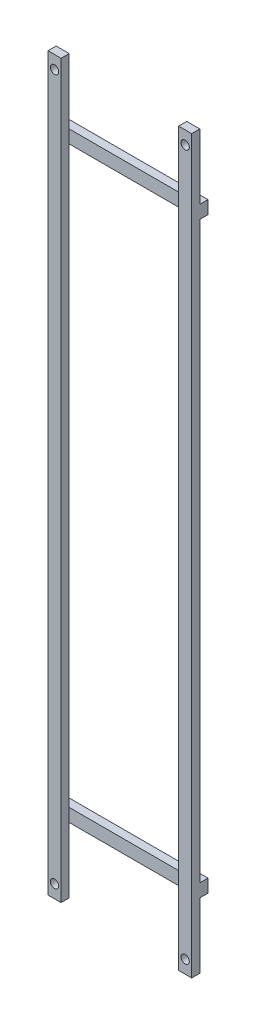
ISO-10303-21;
HEADER;
FILE_DESCRIPTION(('STEP AP214'),'2;1');
FILE_NAME('part.step','',(''),(''),'','','');
FILE_SCHEMA(('AUTOMOTIVE_DESIGN { 1 0 10303 214 1 1 1 1 }'));
ENDSEC;
DATA;
#1=APPLICATION_CONTEXT('core data for automotive mechanical design processes');
#2=APPLICATION_PROTOCOL_DEFINITION('international standard','automotive_design',2000,#1);
#3=PRODUCT_CONTEXT('',#1,'mechanical');
#4=PRODUCT('Part','Part','',(#3));
#5=PRODUCT_RELATED_PRODUCT_CATEGORY('part','',(#4));
#6=PRODUCT_DEFINITION_FORMATION('','',#4);
#7=PRODUCT_DEFINITION_CONTEXT('part definition',#1,'design');
#8=PRODUCT_DEFINITION('design','',#6,#7);
#9=PRODUCT_DEFINITION_SHAPE('','',#8);
#10=(LENGTH_UNIT() NAMED_UNIT(*) SI_UNIT(.MILLI.,.METRE.));
#11=(NAMED_UNIT(*) PLANE_ANGLE_UNIT() SI_UNIT($,.RADIAN.));
#12=(NAMED_UNIT(*) SI_UNIT($,.STERADIAN.) SOLID_ANGLE_UNIT());
#13=UNCERTAINTY_MEASURE_WITH_UNIT(LENGTH_MEASURE(1.E-05),#10,'distance_accuracy_value','');
#14=(GEOMETRIC_REPRESENTATION_CONTEXT(3) GLOBAL_UNCERTAINTY_ASSIGNED_CONTEXT((#13)) GLOBAL_UNIT_ASSIGNED_CONTEXT((#10,
#11,#12)) REPRESENTATION_CONTEXT('',''));
#15=CARTESIAN_POINT('',(0.,0.,0.));
#16=DIRECTION('',(0.,0.,1.));
#17=DIRECTION('',(1.,0.,0.));
#18=AXIS2_PLACEMENT_3D('',#15,#16,#17);
#19=CARTESIAN_POINT('',(220.,-997.383525535419,81.5788462871536));
#20=DIRECTION('',(0.,0.,1.));
#21=DIRECTION('',(1.,0.,0.));
#22=AXIS2_PLACEMENT_3D('',#19,#20,#21);
#23=PLANE('',#22);
#24=DIRECTION('',(-1.,0.,0.));
#25=VECTOR('',#24,1.);
#26=CARTESIAN_POINT('',(220.,762.616474464581,81.5788462871536));
#27=LINE('',#26,#25);
#28=CARTESIAN_POINT('',(220.,762.616474464581,81.5788462871536));
#29=VERTEX_POINT('',#28);
#30=CARTESIAN_POINT('',(180.,762.616474464581,81.5788462871536));
#31=VERTEX_POINT('',#30);
#32=EDGE_CURVE('E363',#29,#31,#27,.T.);
#33=ORIENTED_EDGE('',*,*,#32,.F.);
#34=DIRECTION('',(0.,1.,0.));
#35=VECTOR('',#34,1.);
#36=CARTESIAN_POINT('',(220.,-997.383525535419,81.5788462871536));
#37=LINE('',#36,#35);
#38=CARTESIAN_POINT('',(220.,-997.383525535419,81.5788462871536));
#39=VERTEX_POINT('',#38);
#40=EDGE_CURVE('E323',#39,#29,#37,.T.);
#41=ORIENTED_EDGE('',*,*,#40,.F.);
#42=DIRECTION('',(-1.,0.,0.));
#43=VECTOR('',#42,1.);
#44=CARTESIAN_POINT('',(220.,-997.383525535419,81.5788462871536));
#45=LINE('',#44,#43);
#46=CARTESIAN_POINT('',(180.,-997.383525535419,81.5788462871536));
#47=VERTEX_POINT('',#46);
#48=EDGE_CURVE('E326',#39,#47,#45,.T.);
#49=ORIENTED_EDGE('',*,*,#48,.T.);
#50=DIRECTION('',(0.,1.,0.));
#51=VECTOR('',#50,1.);
#52=CARTESIAN_POINT('',(180.,-997.383525535419,81.5788462871536));
#53=LINE('',#52,#51);
#54=EDGE_CURVE('E322',#47,#31,#53,.T.);
#55=ORIENTED_EDGE('',*,*,#54,.T.);
#56=EDGE_LOOP('',(#33,#41,#49,#55));
#57=FACE_BOUND('',#56,.T.);
#58=ADVANCED_FACE('F35',(#57),#23,.F.);
#59=CARTESIAN_POINT('',(200.,962.616474464581,81.5788462871535));
#60=DIRECTION('',(0.,0.,1.));
#61=DIRECTION('',(-1.,0.,0.));
#62=AXIS2_PLACEMENT_3D('',#59,#60,#61);
#63=CIRCLE('',#62,12.7);
#64=CARTESIAN_POINT('',(187.3,962.616474464581,81.5788462871535));
#65=VERTEX_POINT('',#64);
#66=EDGE_CURVE('E207',#65,#65,#63,.T.);
#67=ORIENTED_EDGE('',*,*,#66,.T.);
#68=EDGE_LOOP('',(#67));
#69=FACE_BOUND('',#68,.T.);
#70=DIRECTION('',(1.,0.,0.));
#71=VECTOR('',#70,1.);
#72=CARTESIAN_POINT('',(220.,802.616474464581,81.5788462871536));
#73=LINE('',#72,#71);
#74=CARTESIAN_POINT('',(180.,802.616474464581,81.5788462871536));
#75=VERTEX_POINT('',#74);
#76=CARTESIAN_POINT('',(220.,802.616474464582,81.5788462871536));
#77=VERTEX_POINT('',#76);
#78=EDGE_CURVE('E361',#75,#77,#73,.T.);
#79=ORIENTED_EDGE('',*,*,#78,.F.);
#80=CARTESIAN_POINT('',(180.,1002.61647446458,81.5788462871535));
#81=VERTEX_POINT('',#80);
#82=EDGE_CURVE('E317',#75,#81,#53,.T.);
#83=ORIENTED_EDGE('',*,*,#82,.T.);
#84=DIRECTION('',(-1.,0.,0.));
#85=VECTOR('',#84,1.);
#86=CARTESIAN_POINT('',(180.,1002.61647446458,81.5788462871535));
#87=LINE('',#86,#85);
#88=CARTESIAN_POINT('',(220.,1002.61647446458,81.5788462871535));
#89=VERTEX_POINT('',#88);
#90=EDGE_CURVE('E213',#89,#81,#87,.T.);
#91=ORIENTED_EDGE('',*,*,#90,.F.);
#92=EDGE_CURVE('E321',#77,#89,#37,.T.);
#93=ORIENTED_EDGE('',*,*,#92,.F.);
#94=EDGE_LOOP('',(#79,#83,#91,#93));
#95=FACE_BOUND('',#94,.T.);
#96=ADVANCED_FACE('F360',(#69,#95),#23,.F.);
#97=CARTESIAN_POINT('',(-3.12509812005868E-13,652.150576606261,81.5788462871536));
#98=DIRECTION('',(0.,0.,-1.));
#99=DIRECTION('',(-1.,0.,0.));
#100=AXIS2_PLACEMENT_3D('',#97,#98,#99);
#101=PLANE('',#100);
#102=DIRECTION('',(0.,-1.,0.));
#103=VECTOR('',#102,1.);
#104=CARTESIAN_POINT('',(-220.,-1237.38352553542,81.5788462871536));
#105=LINE('',#104,#103);
#106=CARTESIAN_POINT('',(-220.,762.616474464581,81.5788462871536));
#107=VERTEX_POINT('',#106);
#108=CARTESIAN_POINT('',(-220.,-997.383525535419,81.5788462871536));
#109=VERTEX_POINT('',#108);
#110=EDGE_CURVE('E275',#107,#109,#105,.T.);
#111=ORIENTED_EDGE('',*,*,#110,.F.);
#112=CARTESIAN_POINT('',(-180.,762.616474464581,81.5788462871536));
#113=VERTEX_POINT('',#112);
#114=EDGE_CURVE('E198',#113,#107,#27,.T.);
#115=ORIENTED_EDGE('',*,*,#114,.F.);
#116=DIRECTION('',(0.,1.,0.));
#117=VECTOR('',#116,1.);
#118=CARTESIAN_POINT('',(-180.,602.616474464581,81.5788462871536));
#119=LINE('',#118,#117);
#120=CARTESIAN_POINT('',(-180.,-997.383525535419,81.5788462871536));
#121=VERTEX_POINT('',#120);
#122=EDGE_CURVE('E383',#121,#113,#119,.T.);
#123=ORIENTED_EDGE('',*,*,#122,.F.);
#124=DIRECTION('',(1.,0.,0.));
#125=VECTOR('',#124,1.);
#126=CARTESIAN_POINT('',(-220.,-997.383525535419,81.5788462871536));
#127=LINE('',#126,#125);
#128=EDGE_CURVE('E301',#109,#121,#127,.T.);
#129=ORIENTED_EDGE('',*,*,#128,.F.);
#130=EDGE_LOOP('',(#111,#115,#123,#129));
#131=FACE_BOUND('',#130,.T.);
#132=ADVANCED_FACE('F381',(#131),#101,.T.);
#133=CARTESIAN_POINT('',(-200.,962.616474464581,81.5788462871535));
#134=DIRECTION('',(0.,0.,1.));
#135=DIRECTION('',(-1.,0.,0.));
#136=AXIS2_PLACEMENT_3D('',#133,#134,#135);
#137=CIRCLE('',#136,12.7000000000001);
#138=CARTESIAN_POINT('',(-212.7,962.616474464581,81.5788462871535));
#139=VERTEX_POINT('',#138);
#140=EDGE_CURVE('E225',#139,#139,#137,.T.);
#141=ORIENTED_EDGE('',*,*,#140,.T.);
#142=EDGE_LOOP('',(#141));
#143=FACE_BOUND('',#142,.T.);
#144=CARTESIAN_POINT('',(-180.,802.616474464581,81.5788462871536));
#145=VERTEX_POINT('',#144);
#146=CARTESIAN_POINT('',(-180.,1002.61647446458,81.5788462871535));
#147=VERTEX_POINT('',#146);
#148=EDGE_CURVE('E280',#145,#147,#119,.T.);
#149=ORIENTED_EDGE('',*,*,#148,.F.);
#150=CARTESIAN_POINT('',(-220.,802.616474464581,81.5788462871536));
#151=VERTEX_POINT('',#150);
#152=EDGE_CURVE('E59',#151,#145,#73,.T.);
#153=ORIENTED_EDGE('',*,*,#152,.F.);
#154=CARTESIAN_POINT('',(-220.,1002.61647446458,81.5788462871535));
#155=VERTEX_POINT('',#154);
#156=EDGE_CURVE('E276',#155,#151,#105,.T.);
#157=ORIENTED_EDGE('',*,*,#156,.F.);
#158=DIRECTION('',(-1.,0.,0.));
#159=VECTOR('',#158,1.);
#160=CARTESIAN_POINT('',(-220.,1002.61647446458,81.5788462871535));
#161=LINE('',#160,#159);
#162=EDGE_CURVE('E231',#147,#155,#161,.T.);
#163=ORIENTED_EDGE('',*,*,#162,.F.);
#164=EDGE_LOOP('',(#149,#153,#157,#163));
#165=FACE_BOUND('',#164,.T.);
#166=ADVANCED_FACE('F398',(#143,#165),#101,.T.);
#167=CARTESIAN_POINT('',(-220.,-997.383525535419,81.5788462871536));
#168=DIRECTION('',(0.,0.,-1.));
#169=DIRECTION('',(0.,1.,0.));
#170=AXIS2_PLACEMENT_3D('',#167,#168,#169);
#171=PLANE('',#170);
#172=CARTESIAN_POINT('',(-180.,-1037.38352553542,81.5788462871536));
#173=VERTEX_POINT('',#172);
#174=EDGE_CURVE('E285',#173,#121,#119,.T.);
#175=ORIENTED_EDGE('',*,*,#174,.F.);
#176=DIRECTION('',(1.,0.,0.));
#177=VECTOR('',#176,1.);
#178=CARTESIAN_POINT('',(-220.,-1037.38352553542,81.5788462871536));
#179=LINE('',#178,#177);
#180=CARTESIAN_POINT('',(180.,-1037.38352553542,81.5788462871535));
#181=VERTEX_POINT('',#180);
#182=EDGE_CURVE('E295',#173,#181,#179,.T.);
#183=ORIENTED_EDGE('',*,*,#182,.T.);
#184=DIRECTION('',(0.,1.,0.));
#185=VECTOR('',#184,1.);
#186=CARTESIAN_POINT('',(180.,-997.383525535419,81.5788462871536));
#187=LINE('',#186,#185);
#188=EDGE_CURVE('E289',#181,#47,#187,.T.);
#189=ORIENTED_EDGE('',*,*,#188,.T.);
#190=EDGE_CURVE('E300',#121,#47,#127,.T.);
#191=ORIENTED_EDGE('',*,*,#190,.F.);
#192=EDGE_LOOP('',(#175,#183,#189,#191));
#193=FACE_BOUND('',#192,.T.);
#194=ADVANCED_FACE('F420',(#193),#171,.F.);
#195=CARTESIAN_POINT('',(180.,652.150576606261,-198.421153712846));
#196=DIRECTION('',(-1.,0.,0.));
#197=DIRECTION('',(0.,0.,1.));
#198=AXIS2_PLACEMENT_3D('',#195,#196,#197);
#199=PLANE('',#198);
#200=DIRECTION('',(0.,-1.,0.));
#201=VECTOR('',#200,1.);
#202=CARTESIAN_POINT('',(180.,652.150576606261,106.578846287154));
#203=LINE('',#202,#201);
#204=CARTESIAN_POINT('',(180.,1002.61647446458,106.578846287154));
#205=VERTEX_POINT('',#204);
#206=CARTESIAN_POINT('',(180.,-1237.38352553542,106.578846287153));
#207=VERTEX_POINT('',#206);
#208=EDGE_CURVE('E254',#205,#207,#203,.T.);
#209=ORIENTED_EDGE('',*,*,#208,.F.);
#210=DIRECTION('',(0.,0.,1.));
#211=VECTOR('',#210,1.);
#212=CARTESIAN_POINT('',(180.,1002.61647446458,81.5788462871535));
#213=LINE('',#212,#211);
#214=EDGE_CURVE('E219',#81,#205,#213,.T.);
#215=ORIENTED_EDGE('',*,*,#214,.F.);
#216=ORIENTED_EDGE('',*,*,#82,.F.);
#217=DIRECTION('',(0.,-1.,0.));
#218=VECTOR('',#217,1.);
#219=CARTESIAN_POINT('',(180.,652.150576606261,81.5788462871536));
#220=LINE('',#219,#218);
#221=EDGE_CURVE('E199',#75,#31,#220,.T.);
#222=ORIENTED_EDGE('',*,*,#221,.T.);
#223=ORIENTED_EDGE('',*,*,#54,.F.);
#224=ORIENTED_EDGE('',*,*,#188,.F.);
#225=DIRECTION('',(0.,1.,0.));
#226=VECTOR('',#225,1.);
#227=CARTESIAN_POINT('',(180.,-1237.38352553542,81.5788462871535));
#228=LINE('',#227,#226);
#229=CARTESIAN_POINT('',(180.,-1237.38352553542,81.5788462871535));
#230=VERTEX_POINT('',#229);
#231=EDGE_CURVE('E304',#230,#181,#228,.T.);
#232=ORIENTED_EDGE('',*,*,#231,.F.);
#233=DIRECTION('',(0.,0.,1.));
#234=VECTOR('',#233,1.);
#235=CARTESIAN_POINT('',(180.,-1237.38352553542,-198.421153712846));
#236=LINE('',#235,#234);
#237=EDGE_CURVE('E331',#230,#207,#236,.T.);
#238=ORIENTED_EDGE('',*,*,#237,.T.);
#239=EDGE_LOOP('',(#209,#215,#216,#222,#223,#224,#232,#238));
#240=FACE_BOUND('',#239,.T.);
#241=ADVANCED_FACE('F338',(#240),#199,.T.);
#242=CARTESIAN_POINT('',(220.,-1237.38352553542,-198.421153712846));
#243=DIRECTION('',(0.,-1.,0.));
#244=DIRECTION('',(0.,0.,-1.));
#245=AXIS2_PLACEMENT_3D('',#242,#243,#244);
#246=PLANE('',#245);
#247=DIRECTION('',(1.,0.,0.));
#248=VECTOR('',#247,1.);
#249=CARTESIAN_POINT('',(220.,-1237.38352553542,106.578846287153));
#250=LINE('',#249,#248);
#251=CARTESIAN_POINT('',(220.,-1237.38352553542,106.578846287153));
#252=VERTEX_POINT('',#251);
#253=EDGE_CURVE('E256',#207,#252,#250,.T.);
#254=ORIENTED_EDGE('',*,*,#253,.F.);
#255=ORIENTED_EDGE('',*,*,#237,.F.);
#256=DIRECTION('',(-1.,0.,0.));
#257=VECTOR('',#256,1.);
#258=CARTESIAN_POINT('',(220.,-1237.38352553542,81.5788462871535));
#259=LINE('',#258,#257);
#260=CARTESIAN_POINT('',(220.,-1237.38352553542,81.5788462871535));
#261=VERTEX_POINT('',#260);
#262=EDGE_CURVE('E311',#261,#230,#259,.T.);
#263=ORIENTED_EDGE('',*,*,#262,.F.);
#264=DIRECTION('',(0.,0.,1.));
#265=VECTOR('',#264,1.);
#266=CARTESIAN_POINT('',(220.,-1237.38352553542,-198.421153712846));
#267=LINE('',#266,#265);
#268=EDGE_CURVE('E44',#261,#252,#267,.T.);
#269=ORIENTED_EDGE('',*,*,#268,.T.);
#270=EDGE_LOOP('',(#254,#255,#263,#269));
#271=FACE_BOUND('',#270,.T.);
#272=ADVANCED_FACE('F37',(#271),#246,.T.);
#273=CARTESIAN_POINT('',(220.,652.150576606261,-198.421153712846));
#274=DIRECTION('',(-1.,0.,0.));
#275=DIRECTION('',(0.,0.,1.));
#276=AXIS2_PLACEMENT_3D('',#273,#274,#275);
#277=PLANE('',#276);
#278=ORIENTED_EDGE('',*,*,#40,.T.);
#279=DIRECTION('',(0.,0.,1.));
#280=VECTOR('',#279,1.);
#281=CARTESIAN_POINT('',(220.,762.616474464581,56.5788462871536));
#282=LINE('',#281,#280);
#283=CARTESIAN_POINT('',(220.,762.616474464581,56.5788462871536));
#284=VERTEX_POINT('',#283);
#285=EDGE_CURVE('E369',#284,#29,#282,.T.);
#286=ORIENTED_EDGE('',*,*,#285,.F.);
#287=DIRECTION('',(0.,-1.,0.));
#288=VECTOR('',#287,1.);
#289=CARTESIAN_POINT('',(220.,762.616474464581,56.5788462871536));
#290=LINE('',#289,#288);
#291=CARTESIAN_POINT('',(220.,802.616474464581,56.5788462871536));
#292=VERTEX_POINT('',#291);
#293=EDGE_CURVE('E190',#292,#284,#290,.T.);
#294=ORIENTED_EDGE('',*,*,#293,.F.);
#295=DIRECTION('',(0.,0.,1.));
#296=VECTOR('',#295,1.);
#297=CARTESIAN_POINT('',(220.,802.616474464581,56.5788462871536));
#298=LINE('',#297,#296);
#299=EDGE_CURVE('E51',#292,#77,#298,.T.);
#300=ORIENTED_EDGE('',*,*,#299,.T.);
#301=ORIENTED_EDGE('',*,*,#92,.T.);
#302=DIRECTION('',(0.,0.,1.));
#303=VECTOR('',#302,1.);
#304=CARTESIAN_POINT('',(220.,1002.61647446458,81.5788462871535));
#305=LINE('',#304,#303);
#306=CARTESIAN_POINT('',(220.,1002.61647446458,106.578846287154));
#307=VERTEX_POINT('',#306);
#308=EDGE_CURVE('E216',#89,#307,#305,.T.);
#309=ORIENTED_EDGE('',*,*,#308,.T.);
#310=DIRECTION('',(0.,1.,0.));
#311=VECTOR('',#310,1.);
#312=CARTESIAN_POINT('',(220.,823.041268335871,106.578846287154));
#313=LINE('',#312,#311);
#314=EDGE_CURVE('E240',#252,#307,#313,.T.);
#315=ORIENTED_EDGE('',*,*,#314,.F.);
#316=ORIENTED_EDGE('',*,*,#268,.F.);
#317=DIRECTION('',(0.,1.,0.));
#318=VECTOR('',#317,1.);
#319=CARTESIAN_POINT('',(220.,-1237.38352553542,81.5788462871535));
#320=LINE('',#319,#318);
#321=CARTESIAN_POINT('',(220.,-1037.38352553542,81.5788462871535));
#322=VERTEX_POINT('',#321);
#323=EDGE_CURVE('E305',#261,#322,#320,.T.);
#324=ORIENTED_EDGE('',*,*,#323,.T.);
#325=DIRECTION('',(0.,0.,-1.));
#326=VECTOR('',#325,1.);
#327=CARTESIAN_POINT('',(220.,-1037.38352553542,81.5788462871535));
#328=LINE('',#327,#326);
#329=CARTESIAN_POINT('',(220.,-1037.38352553542,56.5788462871538));
#330=VERTEX_POINT('',#329);
#331=EDGE_CURVE('E308',#322,#330,#328,.T.);
#332=ORIENTED_EDGE('',*,*,#331,.T.);
#333=DIRECTION('',(0.,-1.,0.));
#334=VECTOR('',#333,1.);
#335=CARTESIAN_POINT('',(220.,866.387601976079,56.5788462871538));
#336=LINE('',#335,#334);
#337=CARTESIAN_POINT('',(220.,-997.383525535419,56.5788462871536));
#338=VERTEX_POINT('',#337);
#339=EDGE_CURVE('E258',#338,#330,#336,.T.);
#340=ORIENTED_EDGE('',*,*,#339,.F.);
#341=DIRECTION('',(0.,0.,1.));
#342=VECTOR('',#341,1.);
#343=CARTESIAN_POINT('',(220.,-997.383525535419,-198.421153712846));
#344=LINE('',#343,#342);
#345=EDGE_CURVE('E319',#338,#39,#344,.T.);
#346=ORIENTED_EDGE('',*,*,#345,.T.);
#347=EDGE_LOOP('',(#278,#286,#294,#300,#301,#309,#315,#316,#324,#332,#340,#346));
#348=FACE_BOUND('',#347,.T.);
#349=ADVANCED_FACE('F349',(#348),#277,.F.);
#350=CARTESIAN_POINT('',(220.,-997.383525535419,-198.421153712846));
#351=DIRECTION('',(0.,-1.,0.));
#352=DIRECTION('',(1.,0.,0.));
#353=AXIS2_PLACEMENT_3D('',#350,#351,#352);
#354=PLANE('',#353);
#355=ORIENTED_EDGE('',*,*,#345,.F.);
#356=DIRECTION('',(-1.,0.,0.));
#357=VECTOR('',#356,1.);
#358=CARTESIAN_POINT('',(220.,-997.383525535419,56.5788462871536));
#359=LINE('',#358,#357);
#360=CARTESIAN_POINT('',(-220.,-997.383525535419,56.5788462871536));
#361=VERTEX_POINT('',#360);
#362=EDGE_CURVE('E263',#338,#361,#359,.T.);
#363=ORIENTED_EDGE('',*,*,#362,.T.);
#364=DIRECTION('',(0.,0.,-1.));
#365=VECTOR('',#364,1.);
#366=CARTESIAN_POINT('',(-220.,-997.383525535419,-198.421153712846));
#367=LINE('',#366,#365);
#368=EDGE_CURVE('E290',#109,#361,#367,.T.);
#369=ORIENTED_EDGE('',*,*,#368,.F.);
#370=ORIENTED_EDGE('',*,*,#128,.T.);
#371=ORIENTED_EDGE('',*,*,#190,.T.);
#372=ORIENTED_EDGE('',*,*,#48,.F.);
#373=EDGE_LOOP('',(#355,#363,#369,#370,#371,#372));
#374=FACE_BOUND('',#373,.T.);
#375=ADVANCED_FACE('F423',(#374),#354,.F.);
#376=CARTESIAN_POINT('',(-220.,652.150576606261,-198.421153712846));
#377=DIRECTION('',(1.,0.,0.));
#378=DIRECTION('',(0.,0.,-1.));
#379=AXIS2_PLACEMENT_3D('',#376,#377,#378);
#380=PLANE('',#379);
#381=DIRECTION('',(0.,1.,0.));
#382=VECTOR('',#381,1.);
#383=CARTESIAN_POINT('',(-220.,652.150576606261,106.578846287154));
#384=LINE('',#383,#382);
#385=CARTESIAN_POINT('',(-220.,-1237.38352553542,106.578846287153));
#386=VERTEX_POINT('',#385);
#387=CARTESIAN_POINT('',(-220.,1002.61647446458,106.578846287154));
#388=VERTEX_POINT('',#387);
#389=EDGE_CURVE('E252',#386,#388,#384,.T.);
#390=ORIENTED_EDGE('',*,*,#389,.T.);
#391=DIRECTION('',(0.,0.,1.));
#392=VECTOR('',#391,1.);
#393=CARTESIAN_POINT('',(-220.,1002.61647446458,81.5788462871535));
#394=LINE('',#393,#392);
#395=EDGE_CURVE('E237',#155,#388,#394,.T.);
#396=ORIENTED_EDGE('',*,*,#395,.F.);
#397=ORIENTED_EDGE('',*,*,#156,.T.);
#398=DIRECTION('',(0.,0.,1.));
#399=VECTOR('',#398,1.);
#400=CARTESIAN_POINT('',(-220.,802.616474464581,56.5788462871536));
#401=LINE('',#400,#399);
#402=CARTESIAN_POINT('',(-220.,802.616474464581,56.5788462871536));
#403=VERTEX_POINT('',#402);
#404=EDGE_CURVE('E182',#403,#151,#401,.T.);
#405=ORIENTED_EDGE('',*,*,#404,.F.);
#406=DIRECTION('',(0.,1.,0.));
#407=VECTOR('',#406,1.);
#408=CARTESIAN_POINT('',(-220.,762.616474464581,56.5788462871536));
#409=LINE('',#408,#407);
#410=CARTESIAN_POINT('',(-220.,762.616474464581,56.5788462871536));
#411=VERTEX_POINT('',#410);
#412=EDGE_CURVE('E175',#411,#403,#409,.T.);
#413=ORIENTED_EDGE('',*,*,#412,.F.);
#414=DIRECTION('',(0.,0.,1.));
#415=VECTOR('',#414,1.);
#416=CARTESIAN_POINT('',(-220.,762.616474464581,56.5788462871536));
#417=LINE('',#416,#415);
#418=EDGE_CURVE('E179',#411,#107,#417,.T.);
#419=ORIENTED_EDGE('',*,*,#418,.T.);
#420=ORIENTED_EDGE('',*,*,#110,.T.);
#421=ORIENTED_EDGE('',*,*,#368,.T.);
#422=DIRECTION('',(0.,-1.,0.));
#423=VECTOR('',#422,1.);
#424=CARTESIAN_POINT('',(-220.,652.150576606261,56.5788462871538));
#425=LINE('',#424,#423);
#426=CARTESIAN_POINT('',(-220.,-1037.38352553542,56.5788462871536));
#427=VERTEX_POINT('',#426);
#428=EDGE_CURVE('E260',#361,#427,#425,.T.);
#429=ORIENTED_EDGE('',*,*,#428,.T.);
#430=DIRECTION('',(0.,0.,1.));
#431=VECTOR('',#430,1.);
#432=CARTESIAN_POINT('',(-220.,-1037.38352553542,81.5788462871536));
#433=LINE('',#432,#431);
#434=CARTESIAN_POINT('',(-220.,-1037.38352553542,81.5788462871536));
#435=VERTEX_POINT('',#434);
#436=EDGE_CURVE('E293',#427,#435,#433,.T.);
#437=ORIENTED_EDGE('',*,*,#436,.T.);
#438=CARTESIAN_POINT('',(-220.,-1237.38352553542,81.5788462871536));
#439=VERTEX_POINT('',#438);
#440=EDGE_CURVE('E272',#435,#439,#105,.T.);
#441=ORIENTED_EDGE('',*,*,#440,.T.);
#442=DIRECTION('',(0.,0.,-1.));
#443=VECTOR('',#442,1.);
#444=CARTESIAN_POINT('',(-220.,-1237.38352553542,121.578846287154));
#445=LINE('',#444,#443);
#446=EDGE_CURVE('E287',#386,#439,#445,.T.);
#447=ORIENTED_EDGE('',*,*,#446,.F.);
#448=EDGE_LOOP('',(#390,#396,#397,#405,#413,#419,#420,#421,#429,#437,#441,#447));
#449=FACE_BOUND('',#448,.T.);
#450=ADVANCED_FACE('F177',(#449),#380,.F.);
#451=CARTESIAN_POINT('',(220.,-1037.38352553542,81.5788462871535));
#452=DIRECTION('',(0.,1.,0.));
#453=DIRECTION('',(-1.,0.,0.));
#454=AXIS2_PLACEMENT_3D('',#451,#452,#453);
#455=PLANE('',#454);
#456=ORIENTED_EDGE('',*,*,#436,.F.);
#457=DIRECTION('',(1.,0.,0.));
#458=VECTOR('',#457,1.);
#459=CARTESIAN_POINT('',(220.,-1037.38352553542,56.5788462871536));
#460=LINE('',#459,#458);
#461=EDGE_CURVE('E11',#427,#330,#460,.T.);
#462=ORIENTED_EDGE('',*,*,#461,.T.);
#463=ORIENTED_EDGE('',*,*,#331,.F.);
#464=DIRECTION('',(-1.,0.,0.));
#465=VECTOR('',#464,1.);
#466=CARTESIAN_POINT('',(220.,-1037.38352553542,81.5788462871535));
#467=LINE('',#466,#465);
#468=EDGE_CURVE('E314',#322,#181,#467,.T.);
#469=ORIENTED_EDGE('',*,*,#468,.T.);
#470=ORIENTED_EDGE('',*,*,#182,.F.);
#471=EDGE_CURVE('E298',#435,#173,#179,.T.);
#472=ORIENTED_EDGE('',*,*,#471,.F.);
#473=EDGE_LOOP('',(#456,#462,#463,#469,#470,#472));
#474=FACE_BOUND('',#473,.T.);
#475=ADVANCED_FACE('F417',(#474),#455,.F.);
#476=CARTESIAN_POINT('',(220.,-1237.38352553542,81.5788462871535));
#477=DIRECTION('',(0.,0.,1.));
#478=DIRECTION('',(1.,0.,0.));
#479=AXIS2_PLACEMENT_3D('',#476,#477,#478);
#480=PLANE('',#479);
#481=CARTESIAN_POINT('',(200.,-1197.38352553542,81.5788462871535));
#482=DIRECTION('',(0.,0.,1.));
#483=DIRECTION('',(1.,0.,0.));
#484=AXIS2_PLACEMENT_3D('',#481,#482,#483);
#485=CIRCLE('',#484,12.7);
#486=CARTESIAN_POINT('',(212.7,-1197.38352553542,81.5788462871535));
#487=VERTEX_POINT('',#486);
#488=EDGE_CURVE('E266',#487,#487,#485,.T.);
#489=ORIENTED_EDGE('',*,*,#488,.T.);
#490=EDGE_LOOP('',(#489));
#491=FACE_BOUND('',#490,.T.);
#492=ORIENTED_EDGE('',*,*,#231,.T.);
#493=ORIENTED_EDGE('',*,*,#468,.F.);
#494=ORIENTED_EDGE('',*,*,#323,.F.);
#495=ORIENTED_EDGE('',*,*,#262,.T.);
#496=EDGE_LOOP('',(#492,#493,#494,#495));
#497=FACE_BOUND('',#496,.T.);
#498=ADVANCED_FACE('F427',(#491,#497),#480,.F.);
#499=CARTESIAN_POINT('',(-200.,-1197.38352553542,81.5788462871536));
#500=DIRECTION('',(0.,0.,-1.));
#501=DIRECTION('',(0.,1.,0.));
#502=AXIS2_PLACEMENT_3D('',#499,#500,#501);
#503=CIRCLE('',#502,12.7);
#504=CARTESIAN_POINT('',(-200.,-1184.68352553542,81.5788462871536));
#505=VERTEX_POINT('',#504);
#506=EDGE_CURVE('E269',#505,#505,#503,.T.);
#507=ORIENTED_EDGE('',*,*,#506,.F.);
#508=EDGE_LOOP('',(#507));
#509=FACE_BOUND('',#508,.T.);
#510=ORIENTED_EDGE('',*,*,#471,.T.);
#511=CARTESIAN_POINT('',(-180.,-1237.38352553542,81.5788462871536));
#512=VERTEX_POINT('',#511);
#513=EDGE_CURVE('E281',#512,#173,#119,.T.);
#514=ORIENTED_EDGE('',*,*,#513,.F.);
#515=DIRECTION('',(1.,0.,0.));
#516=VECTOR('',#515,1.);
#517=CARTESIAN_POINT('',(-180.,-1237.38352553542,81.5788462871536));
#518=LINE('',#517,#516);
#519=EDGE_CURVE('E277',#439,#512,#518,.T.);
#520=ORIENTED_EDGE('',*,*,#519,.F.);
#521=ORIENTED_EDGE('',*,*,#440,.F.);
#522=EDGE_LOOP('',(#510,#514,#520,#521));
#523=FACE_BOUND('',#522,.T.);
#524=ADVANCED_FACE('F412',(#509,#523),#101,.T.);
#525=CARTESIAN_POINT('',(-180.,-1237.38352553542,121.578846287154));
#526=DIRECTION('',(0.,1.,0.));
#527=DIRECTION('',(0.,0.,1.));
#528=AXIS2_PLACEMENT_3D('',#525,#526,#527);
#529=PLANE('',#528);
#530=DIRECTION('',(0.,0.,-1.));
#531=VECTOR('',#530,1.);
#532=CARTESIAN_POINT('',(-180.,-1237.38352553542,121.578846287154));
#533=LINE('',#532,#531);
#534=CARTESIAN_POINT('',(-180.,-1237.38352553542,106.578846287153));
#535=VERTEX_POINT('',#534);
#536=EDGE_CURVE('E284',#535,#512,#533,.T.);
#537=ORIENTED_EDGE('',*,*,#536,.F.);
#538=DIRECTION('',(-1.,0.,0.));
#539=VECTOR('',#538,1.);
#540=CARTESIAN_POINT('',(-180.,-1237.38352553542,106.578846287153));
#541=LINE('',#540,#539);
#542=EDGE_CURVE('E249',#535,#386,#541,.T.);
#543=ORIENTED_EDGE('',*,*,#542,.T.);
#544=ORIENTED_EDGE('',*,*,#446,.T.);
#545=ORIENTED_EDGE('',*,*,#519,.T.);
#546=EDGE_LOOP('',(#537,#543,#544,#545));
#547=FACE_BOUND('',#546,.T.);
#548=ADVANCED_FACE('F409',(#547),#529,.F.);
#549=CARTESIAN_POINT('',(-180.,602.616474464581,121.578846287154));
#550=DIRECTION('',(-1.,0.,0.));
#551=DIRECTION('',(0.,0.,1.));
#552=AXIS2_PLACEMENT_3D('',#549,#550,#551);
#553=PLANE('',#552);
#554=ORIENTED_EDGE('',*,*,#122,.T.);
#555=EDGE_CURVE('E388',#113,#145,#119,.T.);
#556=ORIENTED_EDGE('',*,*,#555,.T.);
#557=ORIENTED_EDGE('',*,*,#148,.T.);
#558=DIRECTION('',(0.,0.,1.));
#559=VECTOR('',#558,1.);
#560=CARTESIAN_POINT('',(-180.,1002.61647446458,81.5788462871535));
#561=LINE('',#560,#559);
#562=CARTESIAN_POINT('',(-180.,1002.61647446458,106.578846287154));
#563=VERTEX_POINT('',#562);
#564=EDGE_CURVE('E234',#147,#563,#561,.T.);
#565=ORIENTED_EDGE('',*,*,#564,.T.);
#566=DIRECTION('',(0.,-1.,0.));
#567=VECTOR('',#566,1.);
#568=CARTESIAN_POINT('',(-180.,602.616474464581,106.578846287154));
#569=LINE('',#568,#567);
#570=EDGE_CURVE('E247',#563,#535,#569,.T.);
#571=ORIENTED_EDGE('',*,*,#570,.T.);
#572=ORIENTED_EDGE('',*,*,#536,.T.);
#573=ORIENTED_EDGE('',*,*,#513,.T.);
#574=ORIENTED_EDGE('',*,*,#174,.T.);
#575=EDGE_LOOP('',(#554,#556,#557,#565,#571,#572,#573,#574));
#576=FACE_BOUND('',#575,.T.);
#577=ADVANCED_FACE('F387',(#576),#553,.F.);
#578=CARTESIAN_POINT('',(-200.,-1197.38352553542,81.5788462871536));
#579=DIRECTION('',(0.,0.,-1.));
#580=DIRECTION('',(0.,1.,0.));
#581=AXIS2_PLACEMENT_3D('',#578,#579,#580);
#582=CYLINDRICAL_SURFACE('',#581,12.7);
#583=CARTESIAN_POINT('',(-200.,-1197.38352553542,106.578846287153));
#584=DIRECTION('',(0.,0.,-1.));
#585=DIRECTION('',(0.,1.,0.));
#586=AXIS2_PLACEMENT_3D('',#583,#584,#585);
#587=CIRCLE('',#586,12.7);
#588=CARTESIAN_POINT('',(-200.,-1184.68352553542,106.578846287153));
#589=VERTEX_POINT('',#588);
#590=EDGE_CURVE('E244',#589,#589,#587,.F.);
#591=ORIENTED_EDGE('',*,*,#590,.T.);
#592=EDGE_LOOP('',(#591));
#593=FACE_BOUND('',#592,.T.);
#594=ORIENTED_EDGE('',*,*,#506,.T.);
#595=EDGE_LOOP('',(#594));
#596=FACE_BOUND('',#595,.T.);
#597=ADVANCED_FACE('F464',(#593,#596),#582,.F.);
#598=CARTESIAN_POINT('',(200.,-1197.38352553542,121.578846287154));
#599=DIRECTION('',(0.,0.,1.));
#600=DIRECTION('',(1.,0.,0.));
#601=AXIS2_PLACEMENT_3D('',#598,#599,#600);
#602=CYLINDRICAL_SURFACE('',#601,12.7);
#603=CARTESIAN_POINT('',(200.,-1197.38352553542,106.578846287153));
#604=DIRECTION('',(0.,0.,-1.));
#605=DIRECTION('',(0.,1.,0.));
#606=AXIS2_PLACEMENT_3D('',#603,#604,#605);
#607=CIRCLE('',#606,12.7);
#608=CARTESIAN_POINT('',(200.,-1184.68352553542,106.578846287153));
#609=VERTEX_POINT('',#608);
#610=EDGE_CURVE('E39',#609,#609,#607,.F.);
#611=ORIENTED_EDGE('',*,*,#610,.T.);
#612=EDGE_LOOP('',(#611));
#613=FACE_BOUND('',#612,.T.);
#614=ORIENTED_EDGE('',*,*,#488,.F.);
#615=EDGE_LOOP('',(#614));
#616=FACE_BOUND('',#615,.T.);
#617=ADVANCED_FACE('F469',(#613,#616),#602,.F.);
#618=CARTESIAN_POINT('',(-380.000000000001,866.387601976079,56.5788462871538));
#619=DIRECTION('',(0.,0.,1.));
#620=DIRECTION('',(0.,-1.,0.));
#621=AXIS2_PLACEMENT_3D('',#618,#619,#620);
#622=PLANE('',#621);
#623=ORIENTED_EDGE('',*,*,#339,.T.);
#624=ORIENTED_EDGE('',*,*,#461,.F.);
#625=ORIENTED_EDGE('',*,*,#428,.F.);
#626=ORIENTED_EDGE('',*,*,#362,.F.);
#627=EDGE_LOOP('',(#623,#624,#625,#626));
#628=FACE_BOUND('',#627,.T.);
#629=ADVANCED_FACE('F425',(#628),#622,.F.);
#630=CARTESIAN_POINT('',(-380.000000000001,823.041268335871,106.578846287154));
#631=DIRECTION('',(0.,0.,-1.));
#632=DIRECTION('',(0.,1.,0.));
#633=AXIS2_PLACEMENT_3D('',#630,#631,#632);
#634=PLANE('',#633);
#635=ORIENTED_EDGE('',*,*,#314,.T.);
#636=DIRECTION('',(-1.,0.,0.));
#637=VECTOR('',#636,1.);
#638=CARTESIAN_POINT('',(180.,1002.61647446458,106.578846287154));
#639=LINE('',#638,#637);
#640=EDGE_CURVE('E210',#307,#205,#639,.T.);
#641=ORIENTED_EDGE('',*,*,#640,.T.);
#642=ORIENTED_EDGE('',*,*,#208,.T.);
#643=ORIENTED_EDGE('',*,*,#253,.T.);
#644=EDGE_LOOP('',(#635,#641,#642,#643));
#645=FACE_BOUND('',#644,.T.);
#646=ORIENTED_EDGE('',*,*,#610,.F.);
#647=EDGE_LOOP('',(#646));
#648=FACE_BOUND('',#647,.T.);
#649=CARTESIAN_POINT('',(200.,962.616474464581,106.578846287154));
#650=DIRECTION('',(0.,0.,1.));
#651=DIRECTION('',(-1.,0.,0.));
#652=AXIS2_PLACEMENT_3D('',#649,#650,#651);
#653=CIRCLE('',#652,12.7);
#654=CARTESIAN_POINT('',(187.3,962.616474464581,106.578846287154));
#655=VERTEX_POINT('',#654);
#656=EDGE_CURVE('E202',#655,#655,#653,.T.);
#657=ORIENTED_EDGE('',*,*,#656,.F.);
#658=EDGE_LOOP('',(#657));
#659=FACE_BOUND('',#658,.T.);
#660=ADVANCED_FACE('F347',(#645,#648,#659),#634,.F.);
#661=ORIENTED_EDGE('',*,*,#590,.F.);
#662=EDGE_LOOP('',(#661));
#663=FACE_BOUND('',#662,.T.);
#664=ORIENTED_EDGE('',*,*,#570,.F.);
#665=DIRECTION('',(-1.,0.,0.));
#666=VECTOR('',#665,1.);
#667=CARTESIAN_POINT('',(-220.,1002.61647446458,106.578846287154));
#668=LINE('',#667,#666);
#669=EDGE_CURVE('E228',#563,#388,#668,.T.);
#670=ORIENTED_EDGE('',*,*,#669,.T.);
#671=ORIENTED_EDGE('',*,*,#389,.F.);
#672=ORIENTED_EDGE('',*,*,#542,.F.);
#673=EDGE_LOOP('',(#664,#670,#671,#672));
#674=FACE_BOUND('',#673,.T.);
#675=CARTESIAN_POINT('',(-200.,962.616474464581,106.578846287154));
#676=DIRECTION('',(0.,0.,1.));
#677=DIRECTION('',(-1.,0.,0.));
#678=AXIS2_PLACEMENT_3D('',#675,#676,#677);
#679=CIRCLE('',#678,12.7000000000001);
#680=CARTESIAN_POINT('',(-212.7,962.616474464581,106.578846287154));
#681=VERTEX_POINT('',#680);
#682=EDGE_CURVE('E222',#681,#681,#679,.T.);
#683=ORIENTED_EDGE('',*,*,#682,.F.);
#684=EDGE_LOOP('',(#683));
#685=FACE_BOUND('',#684,.T.);
#686=ADVANCED_FACE('F402',(#663,#674,#685),#634,.F.);
#687=CARTESIAN_POINT('',(-220.,1002.61647446458,81.5788462871535));
#688=DIRECTION('',(0.,1.,0.));
#689=DIRECTION('',(0.,0.,1.));
#690=AXIS2_PLACEMENT_3D('',#687,#688,#689);
#691=PLANE('',#690);
#692=ORIENTED_EDGE('',*,*,#669,.F.);
#693=ORIENTED_EDGE('',*,*,#564,.F.);
#694=ORIENTED_EDGE('',*,*,#162,.T.);
#695=ORIENTED_EDGE('',*,*,#395,.T.);
#696=EDGE_LOOP('',(#692,#693,#694,#695));
#697=FACE_BOUND('',#696,.T.);
#698=ADVANCED_FACE('F397',(#697),#691,.T.);
#699=CARTESIAN_POINT('',(-200.,962.616474464581,81.5788462871535));
#700=DIRECTION('',(0.,0.,1.));
#701=DIRECTION('',(1.,0.,0.));
#702=AXIS2_PLACEMENT_3D('',#699,#700,#701);
#703=CYLINDRICAL_SURFACE('',#702,12.7000000000001);
#704=ORIENTED_EDGE('',*,*,#140,.F.);
#705=EDGE_LOOP('',(#704));
#706=FACE_BOUND('',#705,.T.);
#707=ORIENTED_EDGE('',*,*,#682,.T.);
#708=EDGE_LOOP('',(#707));
#709=FACE_BOUND('',#708,.T.);
#710=ADVANCED_FACE('F480',(#706,#709),#703,.F.);
#711=CARTESIAN_POINT('',(180.,1002.61647446458,81.5788462871535));
#712=DIRECTION('',(0.,1.,0.));
#713=DIRECTION('',(0.,0.,1.));
#714=AXIS2_PLACEMENT_3D('',#711,#712,#713);
#715=PLANE('',#714);
#716=ORIENTED_EDGE('',*,*,#640,.F.);
#717=ORIENTED_EDGE('',*,*,#308,.F.);
#718=ORIENTED_EDGE('',*,*,#90,.T.);
#719=ORIENTED_EDGE('',*,*,#214,.T.);
#720=EDGE_LOOP('',(#716,#717,#718,#719));
#721=FACE_BOUND('',#720,.T.);
#722=ADVANCED_FACE('F355',(#721),#715,.T.);
#723=CARTESIAN_POINT('',(200.,962.616474464581,81.5788462871535));
#724=DIRECTION('',(0.,0.,1.));
#725=DIRECTION('',(1.,0.,0.));
#726=AXIS2_PLACEMENT_3D('',#723,#724,#725);
#727=CYLINDRICAL_SURFACE('',#726,12.7);
#728=ORIENTED_EDGE('',*,*,#66,.F.);
#729=EDGE_LOOP('',(#728));
#730=FACE_BOUND('',#729,.T.);
#731=ORIENTED_EDGE('',*,*,#656,.T.);
#732=EDGE_LOOP('',(#731));
#733=FACE_BOUND('',#732,.T.);
#734=ADVANCED_FACE('F486',(#730,#733),#727,.F.);
#735=CARTESIAN_POINT('',(0.,0.,81.5788462871536));
#736=DIRECTION('',(0.,0.,-1.));
#737=DIRECTION('',(-1.,0.,0.));
#738=AXIS2_PLACEMENT_3D('',#735,#736,#737);
#739=PLANE('',#738);
#740=ORIENTED_EDGE('',*,*,#221,.F.);
#741=EDGE_CURVE('E362',#145,#75,#73,.T.);
#742=ORIENTED_EDGE('',*,*,#741,.F.);
#743=ORIENTED_EDGE('',*,*,#555,.F.);
#744=EDGE_CURVE('E365',#31,#113,#27,.T.);
#745=ORIENTED_EDGE('',*,*,#744,.F.);
#746=EDGE_LOOP('',(#740,#742,#743,#745));
#747=FACE_BOUND('',#746,.T.);
#748=ADVANCED_FACE('F489',(#747),#739,.F.);
#749=CARTESIAN_POINT('',(220.,762.616474464581,56.5788462871536));
#750=DIRECTION('',(0.,1.,0.));
#751=DIRECTION('',(0.,0.,1.));
#752=AXIS2_PLACEMENT_3D('',#749,#750,#751);
#753=PLANE('',#752);
#754=ORIENTED_EDGE('',*,*,#32,.T.);
#755=ORIENTED_EDGE('',*,*,#744,.T.);
#756=ORIENTED_EDGE('',*,*,#114,.T.);
#757=ORIENTED_EDGE('',*,*,#418,.F.);
#758=DIRECTION('',(-1.,0.,0.));
#759=VECTOR('',#758,1.);
#760=CARTESIAN_POINT('',(220.,762.616474464581,56.5788462871536));
#761=LINE('',#760,#759);
#762=EDGE_CURVE('E186',#284,#411,#761,.T.);
#763=ORIENTED_EDGE('',*,*,#762,.F.);
#764=ORIENTED_EDGE('',*,*,#285,.T.);
#765=EDGE_LOOP('',(#754,#755,#756,#757,#763,#764));
#766=FACE_BOUND('',#765,.T.);
#767=ADVANCED_FACE('F195',(#766),#753,.F.);
#768=CARTESIAN_POINT('',(220.,802.616474464581,56.5788462871536));
#769=DIRECTION('',(0.,-1.,0.));
#770=DIRECTION('',(0.,0.,-1.));
#771=AXIS2_PLACEMENT_3D('',#768,#769,#770);
#772=PLANE('',#771);
#773=ORIENTED_EDGE('',*,*,#152,.T.);
#774=ORIENTED_EDGE('',*,*,#741,.T.);
#775=ORIENTED_EDGE('',*,*,#78,.T.);
#776=ORIENTED_EDGE('',*,*,#299,.F.);
#777=DIRECTION('',(1.,0.,0.));
#778=VECTOR('',#777,1.);
#779=CARTESIAN_POINT('',(220.,802.616474464581,56.5788462871536));
#780=LINE('',#779,#778);
#781=EDGE_CURVE('E185',#403,#292,#780,.T.);
#782=ORIENTED_EDGE('',*,*,#781,.F.);
#783=ORIENTED_EDGE('',*,*,#404,.T.);
#784=EDGE_LOOP('',(#773,#774,#775,#776,#782,#783));
#785=FACE_BOUND('',#784,.T.);
#786=ADVANCED_FACE('F372',(#785),#772,.F.);
#787=CARTESIAN_POINT('',(0.,0.,56.5788462871536));
#788=DIRECTION('',(0.,0.,-1.));
#789=DIRECTION('',(-1.,0.,0.));
#790=AXIS2_PLACEMENT_3D('',#787,#788,#789);
#791=PLANE('',#790);
#792=ORIENTED_EDGE('',*,*,#762,.T.);
#793=ORIENTED_EDGE('',*,*,#412,.T.);
#794=ORIENTED_EDGE('',*,*,#781,.T.);
#795=ORIENTED_EDGE('',*,*,#293,.T.);
#796=EDGE_LOOP('',(#792,#793,#794,#795));
#797=FACE_BOUND('',#796,.T.);
#798=ADVANCED_FACE('F189',(#797),#791,.T.);
#799=CLOSED_SHELL('',(#58,#96,#132,#166,#194,#241,#272,#349,#375,#450,#475,#498,#524,#548,#577,
#597,#617,#629,#660,#686,#698,#710,#722,#734,#748,#767,#786,#798));
#800=MANIFOLD_SOLID_BREP('B2',#799);
#801=ADVANCED_BREP_SHAPE_REPRESENTATION('',(#18,#800),#14);
#802=SHAPE_DEFINITION_REPRESENTATION(#9,#801);
ENDSEC;
END-ISO-10303-21;
